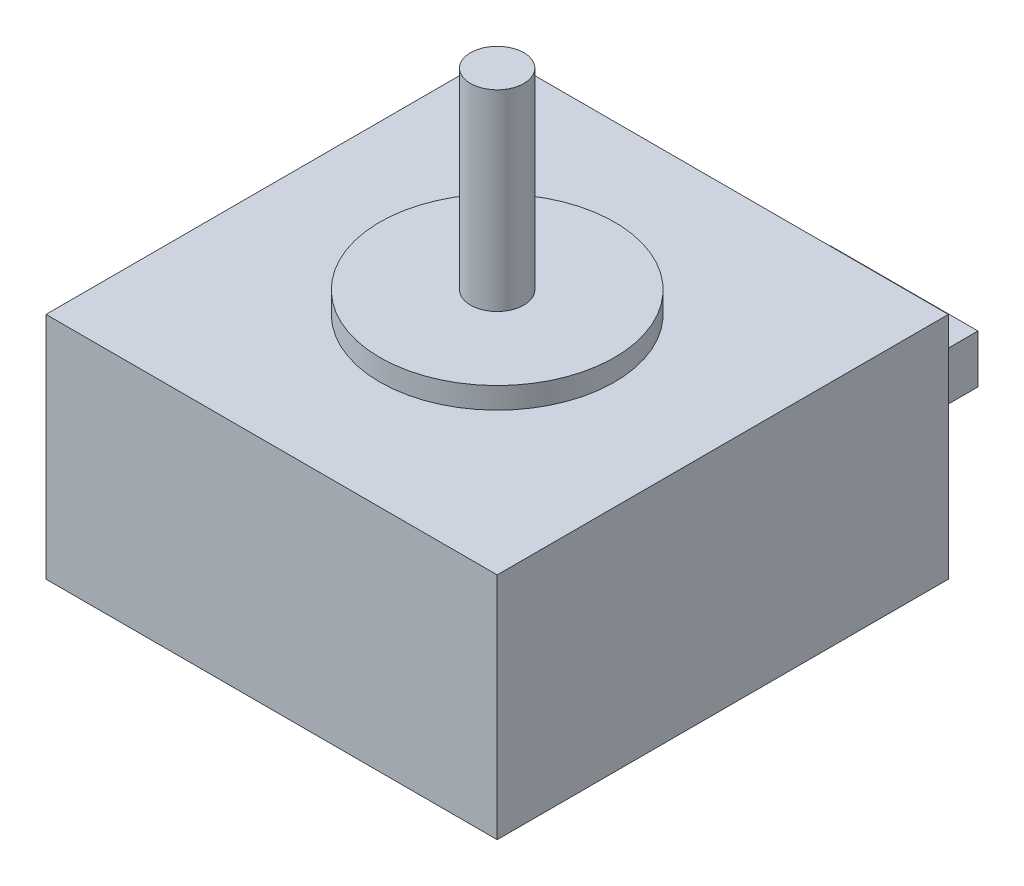
ISO-10303-21;
HEADER;
FILE_DESCRIPTION(('STEP AP214'),'2;1');
FILE_NAME('part.step','',(''),(''),'','','');
FILE_SCHEMA(('AUTOMOTIVE_DESIGN { 1 0 10303 214 1 1 1 1 }'));
ENDSEC;
DATA;
#1=APPLICATION_CONTEXT('core data for automotive mechanical design processes');
#2=APPLICATION_PROTOCOL_DEFINITION('international standard','automotive_design',2000,#1);
#3=PRODUCT_CONTEXT('',#1,'mechanical');
#4=PRODUCT('Part','Part','',(#3));
#5=PRODUCT_RELATED_PRODUCT_CATEGORY('part','',(#4));
#6=PRODUCT_DEFINITION_FORMATION('','',#4);
#7=PRODUCT_DEFINITION_CONTEXT('part definition',#1,'design');
#8=PRODUCT_DEFINITION('design','',#6,#7);
#9=PRODUCT_DEFINITION_SHAPE('','',#8);
#10=(LENGTH_UNIT() NAMED_UNIT(*) SI_UNIT(.MILLI.,.METRE.));
#11=(NAMED_UNIT(*) PLANE_ANGLE_UNIT() SI_UNIT($,.RADIAN.));
#12=(NAMED_UNIT(*) SI_UNIT($,.STERADIAN.) SOLID_ANGLE_UNIT());
#13=UNCERTAINTY_MEASURE_WITH_UNIT(LENGTH_MEASURE(1.E-05),#10,'distance_accuracy_value','');
#14=(GEOMETRIC_REPRESENTATION_CONTEXT(3) GLOBAL_UNCERTAINTY_ASSIGNED_CONTEXT((#13)) GLOBAL_UNIT_ASSIGNED_CONTEXT((#10,
#11,#12)) REPRESENTATION_CONTEXT('',''));
#15=CARTESIAN_POINT('',(0.,0.,0.));
#16=DIRECTION('',(0.,0.,1.));
#17=DIRECTION('',(1.,0.,0.));
#18=AXIS2_PLACEMENT_3D('',#15,#16,#17);
#19=CARTESIAN_POINT('',(-36.3444043321299,21.5,-15.3471119133574));
#20=DIRECTION('',(0.,0.,1.));
#21=DIRECTION('',(1.,0.,0.));
#22=AXIS2_PLACEMENT_3D('',#19,#20,#21);
#23=PLANE('',#22);
#24=DIRECTION('',(0.,-1.,0.));
#25=VECTOR('',#24,1.);
#26=CARTESIAN_POINT('',(-8.26810165079077,4.54245172566645,-15.3471119133574));
#27=LINE('',#26,#25);
#28=CARTESIAN_POINT('',(-8.26810165079077,4.54245172566645,-15.3471119133574));
#29=VERTEX_POINT('',#28);
#30=CARTESIAN_POINT('',(-8.26810165079077,0.,-15.3471119133574));
#31=VERTEX_POINT('',#30);
#32=EDGE_CURVE('E63',#29,#31,#27,.T.);
#33=ORIENTED_EDGE('',*,*,#32,.F.);
#34=DIRECTION('',(1.,0.,0.));
#35=VECTOR('',#34,1.);
#36=CARTESIAN_POINT('',(-8.26810165079077,4.54245172566645,-15.3471119133574));
#37=LINE('',#36,#35);
#38=CARTESIAN_POINT('',(-22.1207070134691,4.54245172566646,-15.3471119133574));
#39=VERTEX_POINT('',#38);
#40=EDGE_CURVE('E135',#39,#29,#37,.T.);
#41=ORIENTED_EDGE('',*,*,#40,.F.);
#42=DIRECTION('',(0.,1.,0.));
#43=VECTOR('',#42,1.);
#44=CARTESIAN_POINT('',(-22.1207070134691,4.54245172566646,-15.3471119133574));
#45=LINE('',#44,#43);
#46=CARTESIAN_POINT('',(-22.1207070134691,0.,-15.3471119133574));
#47=VERTEX_POINT('',#46);
#48=EDGE_CURVE('E69',#47,#39,#45,.T.);
#49=ORIENTED_EDGE('',*,*,#48,.F.);
#50=DIRECTION('',(-1.,0.,0.));
#51=VECTOR('',#50,1.);
#52=CARTESIAN_POINT('',(-36.3444043321299,0.,-15.3471119133574));
#53=LINE('',#52,#51);
#54=CARTESIAN_POINT('',(-36.3444043321299,0.,-15.3471119133574));
#55=VERTEX_POINT('',#54);
#56=EDGE_CURVE('E181',#47,#55,#53,.T.);
#57=ORIENTED_EDGE('',*,*,#56,.T.);
#58=DIRECTION('',(0.,-1.,0.));
#59=VECTOR('',#58,1.);
#60=CARTESIAN_POINT('',(-36.3444043321299,21.5,-15.3471119133574));
#61=LINE('',#60,#59);
#62=CARTESIAN_POINT('',(-36.3444043321299,21.5,-15.3471119133574));
#63=VERTEX_POINT('',#62);
#64=EDGE_CURVE('E171',#63,#55,#61,.T.);
#65=ORIENTED_EDGE('',*,*,#64,.F.);
#66=DIRECTION('',(-1.,0.,0.));
#67=VECTOR('',#66,1.);
#68=CARTESIAN_POINT('',(-36.3444043321299,21.5,-15.3471119133574));
#69=LINE('',#68,#67);
#70=CARTESIAN_POINT('',(5.95559566787006,21.5,-15.3471119133574));
#71=VERTEX_POINT('',#70);
#72=EDGE_CURVE('E168',#71,#63,#69,.T.);
#73=ORIENTED_EDGE('',*,*,#72,.F.);
#74=DIRECTION('',(0.,-1.,0.));
#75=VECTOR('',#74,1.);
#76=CARTESIAN_POINT('',(5.95559566787006,21.5,-15.3471119133574));
#77=LINE('',#76,#75);
#78=CARTESIAN_POINT('',(5.95559566787006,0.,-15.3471119133574));
#79=VERTEX_POINT('',#78);
#80=EDGE_CURVE('E187',#71,#79,#77,.T.);
#81=ORIENTED_EDGE('',*,*,#80,.T.);
#82=EDGE_CURVE('E162',#79,#31,#53,.T.);
#83=ORIENTED_EDGE('',*,*,#82,.T.);
#84=EDGE_LOOP('',(#33,#41,#49,#57,#65,#73,#81,#83));
#85=FACE_BOUND('',#84,.T.);
#86=ADVANCED_FACE('F45',(#85),#23,.F.);
#87=CARTESIAN_POINT('',(-36.3444043321299,21.5,-15.3471119133574));
#88=DIRECTION('',(1.,0.,0.));
#89=DIRECTION('',(0.,0.,-1.));
#90=AXIS2_PLACEMENT_3D('',#87,#88,#89);
#91=PLANE('',#90);
#92=DIRECTION('',(0.,0.,1.));
#93=VECTOR('',#92,1.);
#94=CARTESIAN_POINT('',(-36.3444043321299,0.,-15.3471119133574));
#95=LINE('',#94,#93);
#96=CARTESIAN_POINT('',(-36.3444043321299,0.,26.9528880866426));
#97=VERTEX_POINT('',#96);
#98=EDGE_CURVE('E153',#55,#97,#95,.T.);
#99=ORIENTED_EDGE('',*,*,#98,.T.);
#100=DIRECTION('',(0.,-1.,0.));
#101=VECTOR('',#100,1.);
#102=CARTESIAN_POINT('',(-36.3444043321299,21.5,26.9528880866426));
#103=LINE('',#102,#101);
#104=CARTESIAN_POINT('',(-36.3444043321299,21.5,26.9528880866426));
#105=VERTEX_POINT('',#104);
#106=EDGE_CURVE('E49',#105,#97,#103,.T.);
#107=ORIENTED_EDGE('',*,*,#106,.F.);
#108=DIRECTION('',(0.,0.,1.));
#109=VECTOR('',#108,1.);
#110=CARTESIAN_POINT('',(-36.3444043321299,21.5,-15.3471119133574));
#111=LINE('',#110,#109);
#112=EDGE_CURVE('E157',#63,#105,#111,.T.);
#113=ORIENTED_EDGE('',*,*,#112,.F.);
#114=ORIENTED_EDGE('',*,*,#64,.T.);
#115=EDGE_LOOP('',(#99,#107,#113,#114));
#116=FACE_BOUND('',#115,.T.);
#117=ADVANCED_FACE('F47',(#116),#91,.F.);
#118=CARTESIAN_POINT('',(-36.3444043321299,21.5,26.9528880866426));
#119=DIRECTION('',(0.,0.,-1.));
#120=DIRECTION('',(-1.,0.,0.));
#121=AXIS2_PLACEMENT_3D('',#118,#119,#120);
#122=PLANE('',#121);
#123=DIRECTION('',(1.,0.,0.));
#124=VECTOR('',#123,1.);
#125=CARTESIAN_POINT('',(-36.3444043321299,0.,26.9528880866426));
#126=LINE('',#125,#124);
#127=CARTESIAN_POINT('',(5.95559566787007,0.,26.9528880866426));
#128=VERTEX_POINT('',#127);
#129=EDGE_CURVE('E175',#97,#128,#126,.T.);
#130=ORIENTED_EDGE('',*,*,#129,.T.);
#131=DIRECTION('',(0.,-1.,0.));
#132=VECTOR('',#131,1.);
#133=CARTESIAN_POINT('',(5.95559566787007,21.5,26.9528880866426));
#134=LINE('',#133,#132);
#135=CARTESIAN_POINT('',(5.95559566787007,21.5,26.9528880866426));
#136=VERTEX_POINT('',#135);
#137=EDGE_CURVE('E190',#136,#128,#134,.T.);
#138=ORIENTED_EDGE('',*,*,#137,.F.);
#139=DIRECTION('',(1.,0.,0.));
#140=VECTOR('',#139,1.);
#141=CARTESIAN_POINT('',(-36.3444043321299,21.5,26.9528880866426));
#142=LINE('',#141,#140);
#143=EDGE_CURVE('E161',#105,#136,#142,.T.);
#144=ORIENTED_EDGE('',*,*,#143,.F.);
#145=ORIENTED_EDGE('',*,*,#106,.T.);
#146=EDGE_LOOP('',(#130,#138,#144,#145));
#147=FACE_BOUND('',#146,.T.);
#148=ADVANCED_FACE('F201',(#147),#122,.F.);
#149=CARTESIAN_POINT('',(5.95559566787006,21.5,-15.3471119133574));
#150=DIRECTION('',(-1.,0.,0.));
#151=DIRECTION('',(0.,0.,1.));
#152=AXIS2_PLACEMENT_3D('',#149,#150,#151);
#153=PLANE('',#152);
#154=DIRECTION('',(0.,0.,-1.));
#155=VECTOR('',#154,1.);
#156=CARTESIAN_POINT('',(5.95559566787006,0.,-15.3471119133574));
#157=LINE('',#156,#155);
#158=EDGE_CURVE('E178',#128,#79,#157,.T.);
#159=ORIENTED_EDGE('',*,*,#158,.T.);
#160=ORIENTED_EDGE('',*,*,#80,.F.);
#161=DIRECTION('',(0.,0.,-1.));
#162=VECTOR('',#161,1.);
#163=CARTESIAN_POINT('',(5.95559566787006,21.5,-15.3471119133574));
#164=LINE('',#163,#162);
#165=EDGE_CURVE('E165',#136,#71,#164,.T.);
#166=ORIENTED_EDGE('',*,*,#165,.F.);
#167=ORIENTED_EDGE('',*,*,#137,.T.);
#168=EDGE_LOOP('',(#159,#160,#166,#167));
#169=FACE_BOUND('',#168,.T.);
#170=ADVANCED_FACE('F206',(#169),#153,.F.);
#171=CARTESIAN_POINT('',(0.,21.5,0.));
#172=DIRECTION('',(0.,1.,0.));
#173=DIRECTION('',(0.,0.,1.));
#174=AXIS2_PLACEMENT_3D('',#171,#172,#173);
#175=PLANE('',#174);
#176=CARTESIAN_POINT('',(-15.1944043321299,21.5,5.8028880866426));
#177=DIRECTION('',(0.,1.,0.));
#178=DIRECTION('',(0.,0.,1.));
#179=AXIS2_PLACEMENT_3D('',#176,#177,#178);
#180=CIRCLE('',#179,11.);
#181=CARTESIAN_POINT('',(-15.1944043321299,21.5,16.8028880866426));
#182=VERTEX_POINT('',#181);
#183=EDGE_CURVE('E55',#182,#182,#180,.T.);
#184=ORIENTED_EDGE('',*,*,#183,.F.);
#185=EDGE_LOOP('',(#184));
#186=FACE_BOUND('',#185,.T.);
#187=ORIENTED_EDGE('',*,*,#112,.T.);
#188=ORIENTED_EDGE('',*,*,#143,.T.);
#189=ORIENTED_EDGE('',*,*,#165,.T.);
#190=ORIENTED_EDGE('',*,*,#72,.T.);
#191=EDGE_LOOP('',(#187,#188,#189,#190));
#192=FACE_BOUND('',#191,.T.);
#193=ADVANCED_FACE('F209',(#186,#192),#175,.T.);
#194=CARTESIAN_POINT('',(0.,0.,0.));
#195=DIRECTION('',(0.,1.,0.));
#196=DIRECTION('',(0.,0.,1.));
#197=AXIS2_PLACEMENT_3D('',#194,#195,#196);
#198=PLANE('',#197);
#199=ORIENTED_EDGE('',*,*,#98,.F.);
#200=ORIENTED_EDGE('',*,*,#56,.F.);
#201=DIRECTION('',(0.,0.,1.));
#202=VECTOR('',#201,1.);
#203=CARTESIAN_POINT('',(-22.1207070134691,0.,-32.3471119133574));
#204=LINE('',#203,#202);
#205=CARTESIAN_POINT('',(-22.1207070134691,0.,-32.3471119133574));
#206=VERTEX_POINT('',#205);
#207=EDGE_CURVE('E120',#206,#47,#204,.T.);
#208=ORIENTED_EDGE('',*,*,#207,.F.);
#209=DIRECTION('',(-1.,0.,0.));
#210=VECTOR('',#209,1.);
#211=CARTESIAN_POINT('',(-8.26810165079077,0.,-32.3471119133574));
#212=LINE('',#211,#210);
#213=CARTESIAN_POINT('',(-8.26810165079077,0.,-32.3471119133574));
#214=VERTEX_POINT('',#213);
#215=EDGE_CURVE('E112',#214,#206,#212,.T.);
#216=ORIENTED_EDGE('',*,*,#215,.F.);
#217=DIRECTION('',(0.,0.,1.));
#218=VECTOR('',#217,1.);
#219=CARTESIAN_POINT('',(-8.26810165079077,0.,-32.3471119133574));
#220=LINE('',#219,#218);
#221=EDGE_CURVE('E118',#214,#31,#220,.T.);
#222=ORIENTED_EDGE('',*,*,#221,.T.);
#223=ORIENTED_EDGE('',*,*,#82,.F.);
#224=ORIENTED_EDGE('',*,*,#158,.F.);
#225=ORIENTED_EDGE('',*,*,#129,.F.);
#226=EDGE_LOOP('',(#199,#200,#208,#216,#222,#223,#224,#225));
#227=FACE_BOUND('',#226,.T.);
#228=ADVANCED_FACE('F115',(#227),#198,.F.);
#229=CARTESIAN_POINT('',(-15.1944043321299,23.5,5.8028880866426));
#230=DIRECTION('',(0.,-1.,0.));
#231=DIRECTION('',(0.,0.,-1.));
#232=AXIS2_PLACEMENT_3D('',#229,#230,#231);
#233=CYLINDRICAL_SURFACE('',#232,11.);
#234=CARTESIAN_POINT('',(-15.1944043321299,23.5,5.8028880866426));
#235=DIRECTION('',(0.,1.,0.));
#236=DIRECTION('',(0.,0.,1.));
#237=AXIS2_PLACEMENT_3D('',#234,#235,#236);
#238=CIRCLE('',#237,11.);
#239=CARTESIAN_POINT('',(-15.1944043321299,23.5,16.8028880866426));
#240=VERTEX_POINT('',#239);
#241=EDGE_CURVE('E144',#240,#240,#238,.T.);
#242=ORIENTED_EDGE('',*,*,#241,.F.);
#243=EDGE_LOOP('',(#242));
#244=FACE_BOUND('',#243,.T.);
#245=ORIENTED_EDGE('',*,*,#183,.T.);
#246=EDGE_LOOP('',(#245));
#247=FACE_BOUND('',#246,.T.);
#248=ADVANCED_FACE('F218',(#244,#247),#233,.T.);
#249=CARTESIAN_POINT('',(-15.1944043321299,23.5,5.8028880866426));
#250=DIRECTION('',(0.,1.,0.));
#251=DIRECTION('',(0.,0.,1.));
#252=AXIS2_PLACEMENT_3D('',#249,#250,#251);
#253=PLANE('',#252);
#254=CARTESIAN_POINT('',(-15.1944043321299,23.5,5.8028880866426));
#255=DIRECTION('',(0.,1.,0.));
#256=DIRECTION('',(0.,0.,1.));
#257=AXIS2_PLACEMENT_3D('',#254,#255,#256);
#258=CIRCLE('',#257,2.5);
#259=CARTESIAN_POINT('',(-15.1944043321299,23.5,8.3028880866426));
#260=VERTEX_POINT('',#259);
#261=EDGE_CURVE('E11',#260,#260,#258,.T.);
#262=ORIENTED_EDGE('',*,*,#261,.F.);
#263=EDGE_LOOP('',(#262));
#264=FACE_BOUND('',#263,.T.);
#265=ORIENTED_EDGE('',*,*,#241,.T.);
#266=EDGE_LOOP('',(#265));
#267=FACE_BOUND('',#266,.T.);
#268=ADVANCED_FACE('F262',(#264,#267),#253,.T.);
#269=CARTESIAN_POINT('',(-15.1944043321299,41.5,5.8028880866426));
#270=DIRECTION('',(0.,-1.,0.));
#271=DIRECTION('',(0.,0.,-1.));
#272=AXIS2_PLACEMENT_3D('',#269,#270,#271);
#273=CYLINDRICAL_SURFACE('',#272,2.5);
#274=CARTESIAN_POINT('',(-15.1944043321299,41.5,5.8028880866426));
#275=DIRECTION('',(0.,1.,0.));
#276=DIRECTION('',(0.,0.,1.));
#277=AXIS2_PLACEMENT_3D('',#274,#275,#276);
#278=CIRCLE('',#277,2.5);
#279=CARTESIAN_POINT('',(-15.1944043321299,41.5,8.3028880866426));
#280=VERTEX_POINT('',#279);
#281=EDGE_CURVE('E139',#280,#280,#278,.T.);
#282=ORIENTED_EDGE('',*,*,#281,.F.);
#283=EDGE_LOOP('',(#282));
#284=FACE_BOUND('',#283,.T.);
#285=ORIENTED_EDGE('',*,*,#261,.T.);
#286=EDGE_LOOP('',(#285));
#287=FACE_BOUND('',#286,.T.);
#288=ADVANCED_FACE('F271',(#284,#287),#273,.T.);
#289=CARTESIAN_POINT('',(-15.1944043321299,41.5,5.8028880866426));
#290=DIRECTION('',(0.,1.,0.));
#291=DIRECTION('',(0.,0.,1.));
#292=AXIS2_PLACEMENT_3D('',#289,#290,#291);
#293=PLANE('',#292);
#294=ORIENTED_EDGE('',*,*,#281,.T.);
#295=EDGE_LOOP('',(#294));
#296=FACE_BOUND('',#295,.T.);
#297=ADVANCED_FACE('F281',(#296),#293,.T.);
#298=CARTESIAN_POINT('',(-8.26810165079077,4.54245172566645,-32.3471119133574));
#299=DIRECTION('',(-1.,0.,0.));
#300=DIRECTION('',(0.,0.,1.));
#301=AXIS2_PLACEMENT_3D('',#298,#299,#300);
#302=PLANE('',#301);
#303=ORIENTED_EDGE('',*,*,#32,.T.);
#304=ORIENTED_EDGE('',*,*,#221,.F.);
#305=DIRECTION('',(0.,-1.,0.));
#306=VECTOR('',#305,1.);
#307=CARTESIAN_POINT('',(-8.26810165079077,4.54245172566645,-32.3471119133574));
#308=LINE('',#307,#306);
#309=CARTESIAN_POINT('',(-8.26810165079077,4.54245172566645,-32.3471119133574));
#310=VERTEX_POINT('',#309);
#311=EDGE_CURVE('E125',#310,#214,#308,.T.);
#312=ORIENTED_EDGE('',*,*,#311,.F.);
#313=DIRECTION('',(0.,0.,1.));
#314=VECTOR('',#313,1.);
#315=CARTESIAN_POINT('',(-8.26810165079077,4.54245172566645,-32.3471119133574));
#316=LINE('',#315,#314);
#317=EDGE_CURVE('E333',#310,#29,#316,.T.);
#318=ORIENTED_EDGE('',*,*,#317,.T.);
#319=EDGE_LOOP('',(#303,#304,#312,#318));
#320=FACE_BOUND('',#319,.T.);
#321=ADVANCED_FACE('F137',(#320),#302,.F.);
#322=CARTESIAN_POINT('',(-22.1207070134691,4.54245172566646,-32.3471119133574));
#323=DIRECTION('',(1.,0.,0.));
#324=DIRECTION('',(0.,0.,-1.));
#325=AXIS2_PLACEMENT_3D('',#322,#323,#324);
#326=PLANE('',#325);
#327=ORIENTED_EDGE('',*,*,#48,.T.);
#328=DIRECTION('',(0.,0.,1.));
#329=VECTOR('',#328,1.);
#330=CARTESIAN_POINT('',(-22.1207070134691,4.54245172566646,-32.3471119133574));
#331=LINE('',#330,#329);
#332=CARTESIAN_POINT('',(-22.1207070134691,4.54245172566646,-32.3471119133574));
#333=VERTEX_POINT('',#332);
#334=EDGE_CURVE('E146',#333,#39,#331,.T.);
#335=ORIENTED_EDGE('',*,*,#334,.F.);
#336=DIRECTION('',(0.,1.,0.));
#337=VECTOR('',#336,1.);
#338=CARTESIAN_POINT('',(-22.1207070134691,4.54245172566646,-32.3471119133574));
#339=LINE('',#338,#337);
#340=EDGE_CURVE('E124',#206,#333,#339,.T.);
#341=ORIENTED_EDGE('',*,*,#340,.F.);
#342=ORIENTED_EDGE('',*,*,#207,.T.);
#343=EDGE_LOOP('',(#327,#335,#341,#342));
#344=FACE_BOUND('',#343,.T.);
#345=ADVANCED_FACE('F300',(#344),#326,.F.);
#346=CARTESIAN_POINT('',(-8.26810165079077,4.54245172566645,-32.3471119133574));
#347=DIRECTION('',(0.,-1.,0.));
#348=DIRECTION('',(1.,0.,0.));
#349=AXIS2_PLACEMENT_3D('',#346,#347,#348);
#350=PLANE('',#349);
#351=ORIENTED_EDGE('',*,*,#40,.T.);
#352=ORIENTED_EDGE('',*,*,#317,.F.);
#353=DIRECTION('',(1.,0.,0.));
#354=VECTOR('',#353,1.);
#355=CARTESIAN_POINT('',(-8.26810165079077,4.54245172566645,-32.3471119133574));
#356=LINE('',#355,#354);
#357=EDGE_CURVE('E130',#333,#310,#356,.T.);
#358=ORIENTED_EDGE('',*,*,#357,.F.);
#359=ORIENTED_EDGE('',*,*,#334,.T.);
#360=EDGE_LOOP('',(#351,#352,#358,#359));
#361=FACE_BOUND('',#360,.T.);
#362=ADVANCED_FACE('F308',(#361),#350,.F.);
#363=CARTESIAN_POINT('',(0.,0.,-32.3471119133574));
#364=DIRECTION('',(0.,0.,-1.));
#365=DIRECTION('',(-1.,0.,0.));
#366=AXIS2_PLACEMENT_3D('',#363,#364,#365);
#367=PLANE('',#366);
#368=ORIENTED_EDGE('',*,*,#311,.T.);
#369=ORIENTED_EDGE('',*,*,#215,.T.);
#370=ORIENTED_EDGE('',*,*,#340,.T.);
#371=ORIENTED_EDGE('',*,*,#357,.T.);
#372=EDGE_LOOP('',(#368,#369,#370,#371));
#373=FACE_BOUND('',#372,.T.);
#374=ADVANCED_FACE('F128',(#373),#367,.T.);
#375=CLOSED_SHELL('',(#86,#117,#148,#170,#193,#228,#248,#268,#288,#297,#321,#345,#362,#374));
#376=MANIFOLD_SOLID_BREP('B2',#375);
#377=ADVANCED_BREP_SHAPE_REPRESENTATION('',(#18,#376),#14);
#378=SHAPE_DEFINITION_REPRESENTATION(#9,#377);
ENDSEC;
END-ISO-10303-21;
